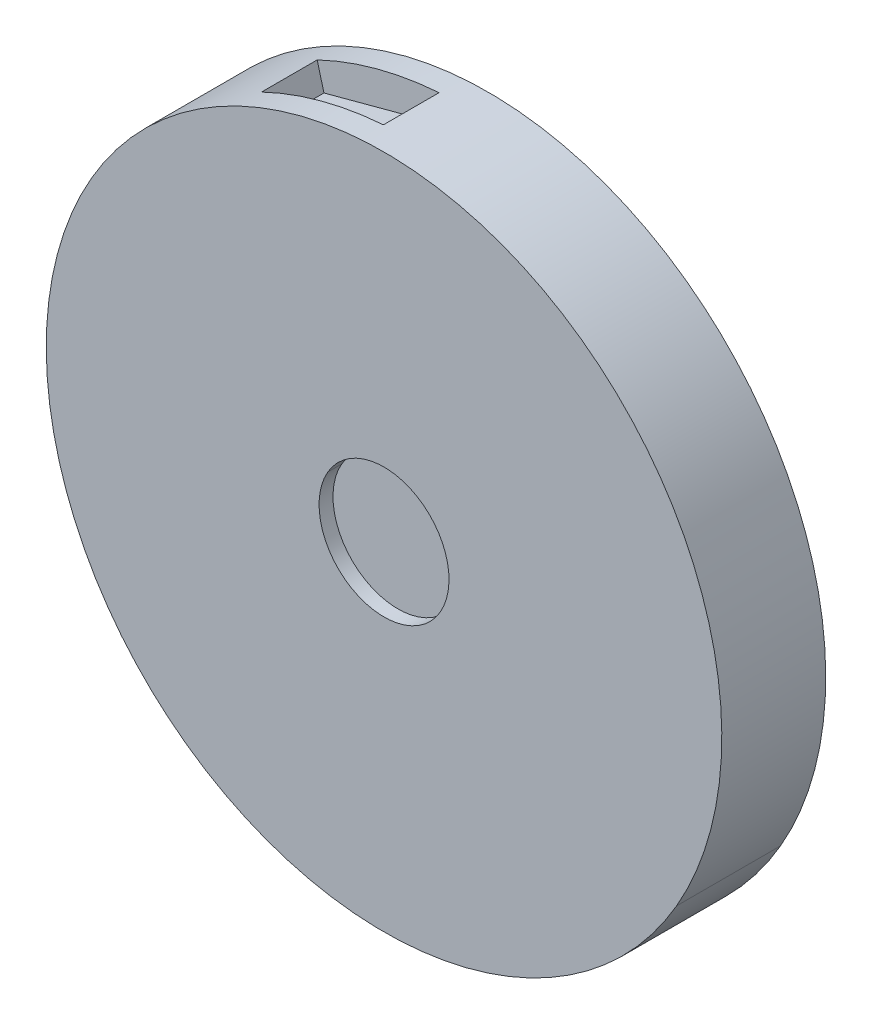
ISO-10303-21;
HEADER;
FILE_DESCRIPTION(('STEP AP214'),'2;1');
FILE_NAME('part.step','',(''),(''),'','','');
FILE_SCHEMA(('AUTOMOTIVE_DESIGN { 1 0 10303 214 1 1 1 1 }'));
ENDSEC;
DATA;
#1=APPLICATION_CONTEXT('core data for automotive mechanical design processes');
#2=APPLICATION_PROTOCOL_DEFINITION('international standard','automotive_design',2000,#1);
#3=PRODUCT_CONTEXT('',#1,'mechanical');
#4=PRODUCT('Part','Part','',(#3));
#5=PRODUCT_RELATED_PRODUCT_CATEGORY('part','',(#4));
#6=PRODUCT_DEFINITION_FORMATION('','',#4);
#7=PRODUCT_DEFINITION_CONTEXT('part definition',#1,'design');
#8=PRODUCT_DEFINITION('design','',#6,#7);
#9=PRODUCT_DEFINITION_SHAPE('','',#8);
#10=(LENGTH_UNIT() NAMED_UNIT(*) SI_UNIT(.MILLI.,.METRE.));
#11=(NAMED_UNIT(*) PLANE_ANGLE_UNIT() SI_UNIT($,.RADIAN.));
#12=(NAMED_UNIT(*) SI_UNIT($,.STERADIAN.) SOLID_ANGLE_UNIT());
#13=UNCERTAINTY_MEASURE_WITH_UNIT(LENGTH_MEASURE(1.E-05),#10,'distance_accuracy_value','');
#14=(GEOMETRIC_REPRESENTATION_CONTEXT(3) GLOBAL_UNCERTAINTY_ASSIGNED_CONTEXT((#13)) GLOBAL_UNIT_ASSIGNED_CONTEXT((#10,
#11,#12)) REPRESENTATION_CONTEXT('',''));
#15=CARTESIAN_POINT('',(0.,0.,0.));
#16=DIRECTION('',(0.,0.,1.));
#17=DIRECTION('',(1.,0.,0.));
#18=AXIS2_PLACEMENT_3D('',#15,#16,#17);
#19=CARTESIAN_POINT('',(-44.4550527685377,16.9656895159303,0.650000000000022));
#20=DIRECTION('',(-0.965925826289068,-0.258819045102523,0.));
#21=DIRECTION('',(-0.258819045102523,0.965925826289068,0.));
#22=AXIS2_PLACEMENT_3D('',#19,#20,#21);
#23=PLANE('',#22);
#24=DIRECTION('',(0.,0.,-1.));
#25=VECTOR('',#24,1.);
#26=CARTESIAN_POINT('',(-44.3021385050177,16.3950057152716,5.));
#27=LINE('',#26,#25);
#28=CARTESIAN_POINT('',(-44.3021385050177,16.3950057152716,1.45000000000002));
#29=VERTEX_POINT('',#28);
#30=CARTESIAN_POINT('',(-44.3021385050177,16.3950057152716,-1.54999999999997));
#31=VERTEX_POINT('',#30);
#32=EDGE_CURVE('E280',#29,#31,#27,.T.);
#33=ORIENTED_EDGE('',*,*,#32,.F.);
#34=DIRECTION('',(-0.258819045102523,0.965925826289068,0.));
#35=VECTOR('',#34,1.);
#36=CARTESIAN_POINT('',(-44.4550527685377,16.9656895159303,1.45000000000002));
#37=LINE('',#36,#35);
#38=CARTESIAN_POINT('',(-43.9374146783326,15.0338378633522,1.45000000000003));
#39=VERTEX_POINT('',#38);
#40=EDGE_CURVE('E256',#39,#29,#37,.T.);
#41=ORIENTED_EDGE('',*,*,#40,.F.);
#42=DIRECTION('',(0.,0.,1.));
#43=VECTOR('',#42,1.);
#44=CARTESIAN_POINT('',(-43.9374146783326,15.0338378633522,-0.749999999999977));
#45=LINE('',#44,#43);
#46=CARTESIAN_POINT('',(-43.9374146783326,15.0338378633522,-1.55));
#47=VERTEX_POINT('',#46);
#48=EDGE_CURVE('E257',#47,#39,#45,.T.);
#49=ORIENTED_EDGE('',*,*,#48,.F.);
#50=DIRECTION('',(0.258819045102523,-0.965925826289068,0.));
#51=VECTOR('',#50,1.);
#52=CARTESIAN_POINT('',(-44.4550527685377,16.9656895159303,-1.54999999999997));
#53=LINE('',#52,#51);
#54=EDGE_CURVE('E28',#31,#47,#53,.T.);
#55=ORIENTED_EDGE('',*,*,#54,.F.);
#56=EDGE_LOOP('',(#33,#41,#49,#55));
#57=FACE_BOUND('',#56,.T.);
#58=ADVANCED_FACE('F17',(#57),#23,.F.);
#59=CARTESIAN_POINT('',(-37.8867570490181,18.7256590496244,-0.749999999999966));
#60=DIRECTION('',(0.965925826289068,0.258819045102523,0.));
#61=DIRECTION('',(0.,0.,-1.));
#62=AXIS2_PLACEMENT_3D('',#59,#60,#61);
#63=PLANE('',#62);
#64=DIRECTION('',(0.,0.,1.));
#65=VECTOR('',#64,1.);
#66=CARTESIAN_POINT('',(-37.7328131492204,18.1511325940641,5.));
#67=LINE('',#66,#65);
#68=CARTESIAN_POINT('',(-37.7328131492204,18.1511325940641,-1.54999999999997));
#69=VERTEX_POINT('',#68);
#70=CARTESIAN_POINT('',(-37.7328131492204,18.1511325940641,1.45000000000002));
#71=VERTEX_POINT('',#70);
#72=EDGE_CURVE('E321',#69,#71,#67,.T.);
#73=ORIENTED_EDGE('',*,*,#72,.F.);
#74=DIRECTION('',(-0.258819045102523,0.965925826289068,0.));
#75=VECTOR('',#74,1.);
#76=CARTESIAN_POINT('',(-37.8867570490181,18.7256590496244,-1.54999999999997));
#77=LINE('',#76,#75);
#78=CARTESIAN_POINT('',(-37.3691189588131,16.7938073970463,-1.54999999999997));
#79=VERTEX_POINT('',#78);
#80=EDGE_CURVE('E11',#79,#69,#77,.T.);
#81=ORIENTED_EDGE('',*,*,#80,.F.);
#82=DIRECTION('',(0.,0.,-1.));
#83=VECTOR('',#82,1.);
#84=CARTESIAN_POINT('',(-37.3691189588131,16.7938073970463,0.650000000000031));
#85=LINE('',#84,#83);
#86=CARTESIAN_POINT('',(-37.3691189588131,16.7938073970463,1.45000000000003));
#87=VERTEX_POINT('',#86);
#88=EDGE_CURVE('E310',#87,#79,#85,.T.);
#89=ORIENTED_EDGE('',*,*,#88,.F.);
#90=DIRECTION('',(0.258819045102523,-0.965925826289068,0.));
#91=VECTOR('',#90,1.);
#92=CARTESIAN_POINT('',(-37.8867570490181,18.7256590496244,1.45000000000002));
#93=LINE('',#92,#91);
#94=EDGE_CURVE('E253',#71,#87,#93,.T.);
#95=ORIENTED_EDGE('',*,*,#94,.F.);
#96=EDGE_LOOP('',(#73,#81,#89,#95));
#97=FACE_BOUND('',#96,.T.);
#98=ADVANCED_FACE('F463',(#97),#63,.F.);
#99=CARTESIAN_POINT('',(-43.9720898553932,17.0950990384816,-1.54999999999997));
#100=DIRECTION('',(0.,0.,-1.));
#101=DIRECTION('',(-1.,0.,0.));
#102=AXIS2_PLACEMENT_3D('',#99,#100,#101);
#103=PLANE('',#102);
#104=CARTESIAN_POINT('',(-36.400000039913,1.44113214695096E-07,-1.55));
#105=DIRECTION('',(0.,0.,-1.));
#106=DIRECTION('',(-0.866025403784439,0.5,0.));
#107=AXIS2_PLACEMENT_3D('',#104,#105,#106);
#108=CIRCLE('',#107,18.2);
#109=EDGE_CURVE('E262',#31,#69,#108,.T.);
#110=ORIENTED_EDGE('',*,*,#109,.F.);
#111=ORIENTED_EDGE('',*,*,#54,.T.);
#112=DIRECTION('',(-0.965925826289068,-0.258819045102523,0.));
#113=VECTOR('',#112,1.);
#114=CARTESIAN_POINT('',(-43.4544517651881,15.1632473859034,-1.55));
#115=LINE('',#114,#113);
#116=EDGE_CURVE('E314',#79,#47,#115,.T.);
#117=ORIENTED_EDGE('',*,*,#116,.F.);
#118=ORIENTED_EDGE('',*,*,#80,.T.);
#119=EDGE_LOOP('',(#110,#111,#117,#118));
#120=FACE_BOUND('',#119,.T.);
#121=ADVANCED_FACE('F469',(#120),#103,.F.);
#122=CARTESIAN_POINT('',(-38.3697199621627,18.5962495270731,1.45000000000003));
#123=DIRECTION('',(0.,0.,1.));
#124=DIRECTION('',(0.,-1.,0.));
#125=AXIS2_PLACEMENT_3D('',#122,#123,#124);
#126=PLANE('',#125);
#127=CARTESIAN_POINT('',(-36.400000039913,1.44113214695096E-07,1.45000000000002));
#128=DIRECTION('',(0.,0.,1.));
#129=DIRECTION('',(-0.866025403784439,0.5,0.));
#130=AXIS2_PLACEMENT_3D('',#127,#128,#129);
#131=CIRCLE('',#130,18.2);
#132=EDGE_CURVE('E333',#71,#29,#131,.T.);
#133=ORIENTED_EDGE('',*,*,#132,.F.);
#134=ORIENTED_EDGE('',*,*,#94,.T.);
#135=DIRECTION('',(0.965925826289068,0.258819045102523,0.));
#136=VECTOR('',#135,1.);
#137=CARTESIAN_POINT('',(-37.8520818719576,16.664397874495,1.45000000000003));
#138=LINE('',#137,#136);
#139=EDGE_CURVE('E222',#39,#87,#138,.T.);
#140=ORIENTED_EDGE('',*,*,#139,.F.);
#141=ORIENTED_EDGE('',*,*,#40,.T.);
#142=EDGE_LOOP('',(#133,#134,#140,#141));
#143=FACE_BOUND('',#142,.T.);
#144=ADVANCED_FACE('F493',(#143),#126,.F.);
#145=CARTESIAN_POINT('',(-40.6532668185729,15.9138226301992,-0.0499999999999723));
#146=DIRECTION('',(-0.258819045102523,0.965925826289068,0.));
#147=DIRECTION('',(0.,0.,1.));
#148=AXIS2_PLACEMENT_3D('',#145,#146,#147);
#149=PLANE('',#148);
#150=ORIENTED_EDGE('',*,*,#139,.T.);
#151=ORIENTED_EDGE('',*,*,#88,.T.);
#152=ORIENTED_EDGE('',*,*,#116,.T.);
#153=ORIENTED_EDGE('',*,*,#48,.T.);
#154=EDGE_LOOP('',(#150,#151,#152,#153));
#155=FACE_BOUND('',#154,.T.);
#156=ADVANCED_FACE('F491',(#155),#149,.T.);
#157=CARTESIAN_POINT('',(-36.400000039913,1.44113214695096E-07,5.));
#158=DIRECTION('',(0.,0.,-1.));
#159=DIRECTION('',(-0.866025403784439,0.5,0.));
#160=AXIS2_PLACEMENT_3D('',#157,#158,#159);
#161=CYLINDRICAL_SURFACE('',#160,18.2);
#162=DIRECTION('',(0.,0.,-1.));
#163=VECTOR('',#162,1.);
#164=CARTESIAN_POINT('',(-20.6383376910362,-9.09999985588678,5.));
#165=LINE('',#164,#163);
#166=CARTESIAN_POINT('',(-20.6383376910362,-9.09999985588678,2.75));
#167=VERTEX_POINT('',#166);
#168=CARTESIAN_POINT('',(-20.6383376910362,-9.09999985588678,-2.85));
#169=VERTEX_POINT('',#168);
#170=EDGE_CURVE('E252',#167,#169,#165,.T.);
#171=ORIENTED_EDGE('',*,*,#170,.F.);
#172=CARTESIAN_POINT('',(-36.400000039913,1.44113214695096E-07,2.75));
#173=DIRECTION('',(0.,0.,-1.));
#174=DIRECTION('',(-0.866025403784439,0.5,0.));
#175=AXIS2_PLACEMENT_3D('',#172,#173,#174);
#176=CIRCLE('',#175,18.2);
#177=CARTESIAN_POINT('',(-52.1616623887898,9.10000014411321,2.75));
#178=VERTEX_POINT('',#177);
#179=EDGE_CURVE('E298',#167,#178,#176,.T.);
#180=ORIENTED_EDGE('',*,*,#179,.T.);
#181=DIRECTION('',(0.,0.,-1.));
#182=VECTOR('',#181,1.);
#183=CARTESIAN_POINT('',(-52.1616623887898,9.10000014411321,5.));
#184=LINE('',#183,#182);
#185=CARTESIAN_POINT('',(-52.1616623887898,9.10000014411321,-2.85));
#186=VERTEX_POINT('',#185);
#187=EDGE_CURVE('E258',#178,#186,#184,.T.);
#188=ORIENTED_EDGE('',*,*,#187,.T.);
#189=CARTESIAN_POINT('',(-36.400000039913,1.44113214695096E-07,-2.85));
#190=DIRECTION('',(0.,0.,-1.));
#191=DIRECTION('',(-0.866025403784439,0.5,0.));
#192=AXIS2_PLACEMENT_3D('',#189,#190,#191);
#193=CIRCLE('',#192,18.2);
#194=EDGE_CURVE('E293',#169,#186,#193,.T.);
#195=ORIENTED_EDGE('',*,*,#194,.F.);
#196=EDGE_LOOP('',(#171,#180,#188,#195));
#197=FACE_BOUND('',#196,.T.);
#198=ADVANCED_FACE('F490',(#197),#161,.T.);
#199=CARTESIAN_POINT('',(-27.0500340703741,-14.5556907143952,-2.84999988079071));
#200=DIRECTION('',(0.,0.,1.));
#201=DIRECTION('',(0.953277739647421,0.302095268239514,0.));
#202=AXIS2_PLACEMENT_3D('',#199,#200,#201);
#203=CYLINDRICAL_SURFACE('',#202,0.2);
#204=CARTESIAN_POINT('',(-27.0500340703741,-14.5556907143952,-2.85));
#205=DIRECTION('',(0.,0.,-1.));
#206=DIRECTION('',(0.953277739647421,0.302095268239514,0.));
#207=AXIS2_PLACEMENT_3D('',#204,#205,#206);
#208=CIRCLE('',#207,0.2);
#209=CARTESIAN_POINT('',(-26.8593785224446,-14.4952716607473,-2.84999988079071));
#210=VERTEX_POINT('',#209);
#211=CARTESIAN_POINT('',(-26.9419419782407,-14.7239645971525,-2.84999988079071));
#212=VERTEX_POINT('',#211);
#213=EDGE_CURVE('E217',#210,#212,#208,.T.);
#214=ORIENTED_EDGE('',*,*,#213,.F.);
#215=DIRECTION('',(0.,0.,1.));
#216=VECTOR('',#215,1.);
#217=CARTESIAN_POINT('',(-26.8593785224446,-14.4952716607473,-2.84999988079071));
#218=LINE('',#217,#216);
#219=CARTESIAN_POINT('',(-26.8593785224447,-14.4952716607473,1.15000011920929));
#220=VERTEX_POINT('',#219);
#221=EDGE_CURVE('E210',#210,#220,#218,.T.);
#222=ORIENTED_EDGE('',*,*,#221,.T.);
#223=CARTESIAN_POINT('',(-27.0500340703741,-14.5556907143952,1.15000011920929));
#224=DIRECTION('',(0.,0.,-1.));
#225=DIRECTION('',(0.953277739647421,0.302095268239514,0.));
#226=AXIS2_PLACEMENT_3D('',#223,#224,#225);
#227=CIRCLE('',#226,0.2);
#228=CARTESIAN_POINT('',(-26.9419419782407,-14.7239645971525,1.15000011920929));
#229=VERTEX_POINT('',#228);
#230=EDGE_CURVE('E214',#220,#229,#227,.T.);
#231=ORIENTED_EDGE('',*,*,#230,.T.);
#232=DIRECTION('',(0.,0.,1.));
#233=VECTOR('',#232,1.);
#234=CARTESIAN_POINT('',(-26.9419419782407,-14.7239645971525,-2.84999988079071));
#235=LINE('',#234,#233);
#236=EDGE_CURVE('E21',#212,#229,#235,.T.);
#237=ORIENTED_EDGE('',*,*,#236,.F.);
#238=EDGE_LOOP('',(#214,#222,#231,#237));
#239=FACE_BOUND('',#238,.T.);
#240=ADVANCED_FACE('F212',(#239),#203,.T.);
#241=CARTESIAN_POINT('',(-24.9528230431498,-13.8910811242682,-2.84999988079071));
#242=DIRECTION('',(0.,0.,1.));
#243=DIRECTION('',(-0.953277739647412,-0.302095268239542,0.));
#244=AXIS2_PLACEMENT_3D('',#241,#242,#243);
#245=CYLINDRICAL_SURFACE('',#244,2.);
#246=CARTESIAN_POINT('',(-24.9528230431498,-13.8910811242682,-2.85));
#247=DIRECTION('',(0.,0.,1.));
#248=DIRECTION('',(-0.953277739647412,-0.302095268239542,0.));
#249=AXIS2_PLACEMENT_3D('',#246,#247,#248);
#250=CIRCLE('',#249,2.);
#251=CARTESIAN_POINT('',(-23.9953811448156,-12.1351468967659,-2.84999988079071));
#252=VERTEX_POINT('',#251);
#253=EDGE_CURVE('E302',#252,#210,#250,.T.);
#254=ORIENTED_EDGE('',*,*,#253,.F.);
#255=DIRECTION('',(0.,0.,1.));
#256=VECTOR('',#255,1.);
#257=CARTESIAN_POINT('',(-23.9953811448156,-12.1351468967659,-2.84999988079071));
#258=LINE('',#257,#256);
#259=CARTESIAN_POINT('',(-23.9953811448156,-12.1351468967659,1.15000011920929));
#260=VERTEX_POINT('',#259);
#261=EDGE_CURVE('E223',#252,#260,#258,.T.);
#262=ORIENTED_EDGE('',*,*,#261,.T.);
#263=CARTESIAN_POINT('',(-24.9528230431498,-13.8910811242682,1.15000011920929));
#264=DIRECTION('',(0.,0.,1.));
#265=DIRECTION('',(-0.953277739647412,-0.302095268239542,0.));
#266=AXIS2_PLACEMENT_3D('',#263,#264,#265);
#267=CIRCLE('',#266,2.);
#268=EDGE_CURVE('E226',#260,#220,#267,.T.);
#269=ORIENTED_EDGE('',*,*,#268,.T.);
#270=ORIENTED_EDGE('',*,*,#221,.F.);
#271=EDGE_LOOP('',(#254,#262,#269,#270));
#272=FACE_BOUND('',#271,.T.);
#273=ADVANCED_FACE('F227',(#272),#245,.F.);
#274=CARTESIAN_POINT('',(-23.8996369549822,-11.9595534740156,-2.84999988079071));
#275=DIRECTION('',(0.,0.,1.));
#276=DIRECTION('',(0.72256434016937,-0.691303677348532,0.));
#277=AXIS2_PLACEMENT_3D('',#274,#275,#276);
#278=CYLINDRICAL_SURFACE('',#277,0.200000000000009);
#279=CARTESIAN_POINT('',(-23.8996369549822,-11.9595534740156,-2.85));
#280=DIRECTION('',(0.,0.,-1.));
#281=DIRECTION('',(0.72256434016937,-0.691303677348532,0.));
#282=AXIS2_PLACEMENT_3D('',#279,#280,#281);
#283=CIRCLE('',#282,0.200000000000009);
#284=CARTESIAN_POINT('',(-23.7551240869483,-12.0978142094853,-2.84999988079071));
#285=VERTEX_POINT('',#284);
#286=EDGE_CURVE('E289',#285,#252,#283,.T.);
#287=ORIENTED_EDGE('',*,*,#286,.F.);
#288=DIRECTION('',(0.,0.,1.));
#289=VECTOR('',#288,1.);
#290=CARTESIAN_POINT('',(-23.7551240869483,-12.0978142094853,-2.84999988079071));
#291=LINE('',#290,#289);
#292=CARTESIAN_POINT('',(-23.7551240869483,-12.0978142094854,1.15000011920929));
#293=VERTEX_POINT('',#292);
#294=EDGE_CURVE('E290',#285,#293,#291,.T.);
#295=ORIENTED_EDGE('',*,*,#294,.T.);
#296=CARTESIAN_POINT('',(-23.8996369549822,-11.9595534740156,1.15000011920929));
#297=DIRECTION('',(0.,0.,-1.));
#298=DIRECTION('',(0.72256434016937,-0.691303677348532,0.));
#299=AXIS2_PLACEMENT_3D('',#296,#297,#298);
#300=CIRCLE('',#299,0.200000000000009);
#301=EDGE_CURVE('E232',#293,#260,#300,.T.);
#302=ORIENTED_EDGE('',*,*,#301,.T.);
#303=ORIENTED_EDGE('',*,*,#261,.F.);
#304=EDGE_LOOP('',(#287,#295,#302,#303));
#305=FACE_BOUND('',#304,.T.);
#306=ADVANCED_FACE('F450',(#305),#278,.T.);
#307=CARTESIAN_POINT('',(-36.400000039913,1.44113210254204E-07,-2.84999988079071));
#308=DIRECTION('',(0.,0.,1.));
#309=DIRECTION('',(0.642787627309709,0.766044428331382,0.));
#310=AXIS2_PLACEMENT_3D('',#307,#308,#309);
#311=CYLINDRICAL_SURFACE('',#310,17.5);
#312=CARTESIAN_POINT('',(-36.400000039913,1.44113210254204E-07,-2.85));
#313=DIRECTION('',(0.,0.,1.));
#314=DIRECTION('',(0.642787627309709,0.766044428331382,0.));
#315=AXIS2_PLACEMENT_3D('',#312,#313,#314);
#316=CIRCLE('',#315,17.5);
#317=EDGE_CURVE('E285',#212,#285,#316,.T.);
#318=ORIENTED_EDGE('',*,*,#317,.F.);
#319=ORIENTED_EDGE('',*,*,#236,.T.);
#320=CARTESIAN_POINT('',(-36.400000039913,1.44113214695096E-07,1.15000011920929));
#321=DIRECTION('',(0.,0.,1.));
#322=DIRECTION('',(0.642787627309709,0.766044428331382,0.));
#323=AXIS2_PLACEMENT_3D('',#320,#321,#322);
#324=CIRCLE('',#323,17.5);
#325=EDGE_CURVE('E236',#229,#293,#324,.T.);
#326=ORIENTED_EDGE('',*,*,#325,.T.);
#327=ORIENTED_EDGE('',*,*,#294,.F.);
#328=EDGE_LOOP('',(#318,#319,#326,#327));
#329=FACE_BOUND('',#328,.T.);
#330=ADVANCED_FACE('F448',(#329),#311,.F.);
#331=CARTESIAN_POINT('',(-36.4000003317925,-2.03614214377978E-07,1.15000011920929));
#332=DIRECTION('',(0.,0.,-1.));
#333=DIRECTION('',(-1.,0.,0.));
#334=AXIS2_PLACEMENT_3D('',#331,#332,#333);
#335=PLANE('',#334);
#336=ORIENTED_EDGE('',*,*,#325,.F.);
#337=ORIENTED_EDGE('',*,*,#230,.F.);
#338=ORIENTED_EDGE('',*,*,#268,.F.);
#339=ORIENTED_EDGE('',*,*,#301,.F.);
#340=EDGE_LOOP('',(#336,#337,#338,#339));
#341=FACE_BOUND('',#340,.T.);
#342=ADVANCED_FACE('F234',(#341),#335,.T.);
#343=CARTESIAN_POINT('',(-49.2162630622612,-11.620387204938,-2.84999988079071));
#344=DIRECTION('',(0.,0.,1.));
#345=DIRECTION('',(-0.740824452158907,-0.671698690696547,0.));
#346=AXIS2_PLACEMENT_3D('',#343,#344,#345);
#347=CYLINDRICAL_SURFACE('',#346,0.200000000000031);
#348=CARTESIAN_POINT('',(-49.2162630622612,-11.620387204938,-2.85));
#349=DIRECTION('',(0.,0.,-1.));
#350=DIRECTION('',(-0.740824452158907,-0.671698690696547,0.));
#351=AXIS2_PLACEMENT_3D('',#348,#349,#350);
#352=CIRCLE('',#351,0.200000000000031);
#353=CARTESIAN_POINT('',(-49.364427952693,-11.7547269430773,-2.84999988079071));
#354=VERTEX_POINT('',#353);
#355=CARTESIAN_POINT('',(-49.4043798111009,-11.5524748437213,-2.84999988079071));
#356=VERTEX_POINT('',#355);
#357=EDGE_CURVE('E268',#354,#356,#352,.T.);
#358=ORIENTED_EDGE('',*,*,#357,.F.);
#359=DIRECTION('',(0.,0.,1.));
#360=VECTOR('',#359,1.);
#361=CARTESIAN_POINT('',(-49.364427952693,-11.7547269430773,-2.84999988079071));
#362=LINE('',#361,#360);
#363=CARTESIAN_POINT('',(-49.364427952693,-11.7547269430773,1.15000011920929));
#364=VERTEX_POINT('',#363);
#365=EDGE_CURVE('E99',#354,#364,#362,.T.);
#366=ORIENTED_EDGE('',*,*,#365,.T.);
#367=CARTESIAN_POINT('',(-49.2162630622612,-11.620387204938,1.15000011920929));
#368=DIRECTION('',(0.,0.,-1.));
#369=DIRECTION('',(-0.740824452158907,-0.671698690696547,0.));
#370=AXIS2_PLACEMENT_3D('',#367,#368,#369);
#371=CIRCLE('',#370,0.200000000000031);
#372=CARTESIAN_POINT('',(-49.4043798111009,-11.5524748437213,1.15000011920929));
#373=VERTEX_POINT('',#372);
#374=EDGE_CURVE('E303',#364,#373,#371,.T.);
#375=ORIENTED_EDGE('',*,*,#374,.T.);
#376=DIRECTION('',(0.,0.,1.));
#377=VECTOR('',#376,1.);
#378=CARTESIAN_POINT('',(-49.4043798111009,-11.5524748437213,-2.84999988079071));
#379=LINE('',#378,#377);
#380=EDGE_CURVE('E359',#356,#373,#379,.T.);
#381=ORIENTED_EDGE('',*,*,#380,.F.);
#382=EDGE_LOOP('',(#358,#366,#375,#381));
#383=FACE_BOUND('',#382,.T.);
#384=ADVANCED_FACE('F507',(#383),#347,.T.);
#385=CARTESIAN_POINT('',(-36.400000039913,1.44113210254204E-07,-2.84999988079071));
#386=DIRECTION('',(0.,0.,1.));
#387=DIRECTION('',(0.642787627309709,0.766044428331382,0.));
#388=AXIS2_PLACEMENT_3D('',#385,#386,#387);
#389=CYLINDRICAL_SURFACE('',#388,17.5);
#390=CARTESIAN_POINT('',(-36.400000039913,1.44113210254204E-07,-2.85));
#391=DIRECTION('',(0.,0.,1.));
#392=DIRECTION('',(0.642787627309709,0.766044428331382,0.));
#393=AXIS2_PLACEMENT_3D('',#390,#391,#392);
#394=CIRCLE('',#393,17.5);
#395=CARTESIAN_POINT('',(-50.4158559843671,-10.4788252740485,-2.84999988079071));
#396=VERTEX_POINT('',#395);
#397=EDGE_CURVE('E284',#396,#354,#394,.T.);
#398=ORIENTED_EDGE('',*,*,#397,.F.);
#399=DIRECTION('',(0.,0.,1.));
#400=VECTOR('',#399,1.);
#401=CARTESIAN_POINT('',(-50.4158559843671,-10.4788252740485,-2.84999988079071));
#402=LINE('',#401,#400);
#403=CARTESIAN_POINT('',(-50.4158559843671,-10.4788252740485,1.15000011920929));
#404=VERTEX_POINT('',#403);
#405=EDGE_CURVE('E82',#396,#404,#402,.T.);
#406=ORIENTED_EDGE('',*,*,#405,.T.);
#407=CARTESIAN_POINT('',(-36.400000039913,1.44113219135988E-07,1.15000011920929));
#408=DIRECTION('',(0.,0.,1.));
#409=DIRECTION('',(0.642787627309709,0.766044428331382,0.));
#410=AXIS2_PLACEMENT_3D('',#407,#408,#409);
#411=CIRCLE('',#410,17.5);
#412=EDGE_CURVE('E306',#404,#364,#411,.T.);
#413=ORIENTED_EDGE('',*,*,#412,.T.);
#414=ORIENTED_EDGE('',*,*,#365,.F.);
#415=EDGE_LOOP('',(#398,#406,#413,#414));
#416=FACE_BOUND('',#415,.T.);
#417=ADVANCED_FACE('F19',(#416),#389,.F.);
#418=CARTESIAN_POINT('',(-50.2556747735733,-10.3590672692695,-2.84999988079071));
#419=DIRECTION('',(0.,0.,1.));
#420=DIRECTION('',(0.153533846656686,-0.988143389357436,0.));
#421=AXIS2_PLACEMENT_3D('',#418,#419,#420);
#422=CYLINDRICAL_SURFACE('',#421,0.200000000000019);
#423=CARTESIAN_POINT('',(-50.2556747735733,-10.3590672692695,-2.85));
#424=DIRECTION('',(0.,0.,-1.));
#425=DIRECTION('',(0.153533846656686,-0.988143389357436,0.));
#426=AXIS2_PLACEMENT_3D('',#423,#424,#425);
#427=CIRCLE('',#426,0.200000000000019);
#428=CARTESIAN_POINT('',(-50.224968004242,-10.556695947141,-2.84999988079071));
#429=VERTEX_POINT('',#428);
#430=EDGE_CURVE('E274',#429,#396,#427,.T.);
#431=ORIENTED_EDGE('',*,*,#430,.F.);
#432=DIRECTION('',(0.,0.,1.));
#433=VECTOR('',#432,1.);
#434=CARTESIAN_POINT('',(-50.224968004242,-10.556695947141,-2.84999988079071));
#435=LINE('',#434,#433);
#436=CARTESIAN_POINT('',(-50.224968004242,-10.556695947141,1.15000011920929));
#437=VERTEX_POINT('',#436);
#438=EDGE_CURVE('E342',#429,#437,#435,.T.);
#439=ORIENTED_EDGE('',*,*,#438,.T.);
#440=CARTESIAN_POINT('',(-50.2556747735733,-10.3590672692695,1.15000011920929));
#441=DIRECTION('',(0.,0.,-1.));
#442=DIRECTION('',(0.153533846656686,-0.988143389357436,0.));
#443=AXIS2_PLACEMENT_3D('',#440,#441,#442);
#444=CIRCLE('',#443,0.200000000000019);
#445=EDGE_CURVE('E386',#437,#404,#444,.T.);
#446=ORIENTED_EDGE('',*,*,#445,.T.);
#447=ORIENTED_EDGE('',*,*,#405,.F.);
#448=EDGE_LOOP('',(#431,#439,#446,#447));
#449=FACE_BOUND('',#448,.T.);
#450=ADVANCED_FACE('F513',(#449),#422,.T.);
#451=CARTESIAN_POINT('',(-50.1098176192494,-11.297803489159,-2.84999988079071));
#452=DIRECTION('',(0.,0.,1.));
#453=DIRECTION('',(-0.153533846656774,0.988143389357422,0.));
#454=AXIS2_PLACEMENT_3D('',#451,#452,#453);
#455=CYLINDRICAL_SURFACE('',#454,0.75);
#456=CARTESIAN_POINT('',(-50.1098176192494,-11.297803489159,-2.85));
#457=DIRECTION('',(0.,0.,1.));
#458=DIRECTION('',(-0.153533846656774,0.988143389357422,0.));
#459=AXIS2_PLACEMENT_3D('',#456,#457,#458);
#460=CIRCLE('',#459,0.75);
#461=EDGE_CURVE('E270',#356,#429,#460,.T.);
#462=ORIENTED_EDGE('',*,*,#461,.F.);
#463=ORIENTED_EDGE('',*,*,#380,.T.);
#464=CARTESIAN_POINT('',(-50.1098176192494,-11.297803489159,1.15000011920929));
#465=DIRECTION('',(0.,0.,1.));
#466=DIRECTION('',(-0.153533846656774,0.988143389357422,0.));
#467=AXIS2_PLACEMENT_3D('',#464,#465,#466);
#468=CIRCLE('',#467,0.75);
#469=EDGE_CURVE('E307',#373,#437,#468,.T.);
#470=ORIENTED_EDGE('',*,*,#469,.T.);
#471=ORIENTED_EDGE('',*,*,#438,.F.);
#472=EDGE_LOOP('',(#462,#463,#470,#471));
#473=FACE_BOUND('',#472,.T.);
#474=ADVANCED_FACE('F510',(#473),#455,.F.);
#475=CARTESIAN_POINT('',(-36.4000003317925,-2.03614209937086E-07,1.15000011920929));
#476=DIRECTION('',(0.,0.,-1.));
#477=DIRECTION('',(-1.,0.,0.));
#478=AXIS2_PLACEMENT_3D('',#475,#476,#477);
#479=PLANE('',#478);
#480=ORIENTED_EDGE('',*,*,#469,.F.);
#481=ORIENTED_EDGE('',*,*,#374,.F.);
#482=ORIENTED_EDGE('',*,*,#412,.F.);
#483=ORIENTED_EDGE('',*,*,#445,.F.);
#484=EDGE_LOOP('',(#480,#481,#482,#483));
#485=FACE_BOUND('',#484,.T.);
#486=ADVANCED_FACE('F475',(#485),#479,.T.);
#487=CARTESIAN_POINT('',(-45.7499660094519,14.5556910026216,-2.84999988079071));
#488=DIRECTION('',(0.,0.,1.));
#489=DIRECTION('',(-0.953277739647408,-0.302095268239553,0.));
#490=AXIS2_PLACEMENT_3D('',#487,#488,#489);
#491=CYLINDRICAL_SURFACE('',#490,0.200000000000003);
#492=CARTESIAN_POINT('',(-45.7499660094519,14.5556910026216,-2.85));
#493=DIRECTION('',(0.,0.,-1.));
#494=DIRECTION('',(-0.953277739647408,-0.302095268239553,0.));
#495=AXIS2_PLACEMENT_3D('',#492,#493,#494);
#496=CIRCLE('',#495,0.200000000000003);
#497=CARTESIAN_POINT('',(-45.9406215573814,14.4952719489737,-2.84999988079071));
#498=VERTEX_POINT('',#497);
#499=CARTESIAN_POINT('',(-45.8580581015853,14.7239648853789,-2.84999988079071));
#500=VERTEX_POINT('',#499);
#501=EDGE_CURVE('E296',#498,#500,#496,.T.);
#502=ORIENTED_EDGE('',*,*,#501,.F.);
#503=DIRECTION('',(0.,0.,1.));
#504=VECTOR('',#503,1.);
#505=CARTESIAN_POINT('',(-45.9406215573814,14.4952719489737,-2.84999988079071));
#506=LINE('',#505,#504);
#507=CARTESIAN_POINT('',(-45.9406215573814,14.4952719489737,1.15000011920929));
#508=VERTEX_POINT('',#507);
#509=EDGE_CURVE('E383',#498,#508,#506,.T.);
#510=ORIENTED_EDGE('',*,*,#509,.T.);
#511=CARTESIAN_POINT('',(-45.7499660094519,14.5556910026216,1.15000011920929));
#512=DIRECTION('',(0.,0.,-1.));
#513=DIRECTION('',(-0.953277739647408,-0.302095268239553,0.));
#514=AXIS2_PLACEMENT_3D('',#511,#512,#513);
#515=CIRCLE('',#514,0.200000000000003);
#516=CARTESIAN_POINT('',(-45.8580581015853,14.7239648853789,1.15000011920929));
#517=VERTEX_POINT('',#516);
#518=EDGE_CURVE('E360',#508,#517,#515,.T.);
#519=ORIENTED_EDGE('',*,*,#518,.T.);
#520=DIRECTION('',(0.,0.,1.));
#521=VECTOR('',#520,1.);
#522=CARTESIAN_POINT('',(-45.8580581015853,14.7239648853789,-2.84999988079071));
#523=LINE('',#522,#521);
#524=EDGE_CURVE('E365',#500,#517,#523,.T.);
#525=ORIENTED_EDGE('',*,*,#524,.F.);
#526=EDGE_LOOP('',(#502,#510,#519,#525));
#527=FACE_BOUND('',#526,.T.);
#528=ADVANCED_FACE('F535',(#527),#491,.T.);
#529=CARTESIAN_POINT('',(-47.8471770366762,13.8910814124946,-2.84999988079071));
#530=DIRECTION('',(0.,0.,1.));
#531=DIRECTION('',(0.953277739647409,0.302095268239553,0.));
#532=AXIS2_PLACEMENT_3D('',#529,#530,#531);
#533=CYLINDRICAL_SURFACE('',#532,2.);
#534=CARTESIAN_POINT('',(-47.8471770366762,13.8910814124946,-2.85));
#535=DIRECTION('',(0.,0.,1.));
#536=DIRECTION('',(0.953277739647409,0.302095268239553,0.));
#537=AXIS2_PLACEMENT_3D('',#534,#535,#536);
#538=CIRCLE('',#537,2.);
#539=CARTESIAN_POINT('',(-48.8046189350104,12.1351471849923,-2.84999988079071));
#540=VERTEX_POINT('',#539);
#541=EDGE_CURVE('E264',#540,#498,#538,.T.);
#542=ORIENTED_EDGE('',*,*,#541,.F.);
#543=DIRECTION('',(0.,0.,1.));
#544=VECTOR('',#543,1.);
#545=CARTESIAN_POINT('',(-48.8046189350104,12.1351471849923,-2.84999988079071));
#546=LINE('',#545,#544);
#547=CARTESIAN_POINT('',(-48.8046189350104,12.1351471849923,1.15000011920929));
#548=VERTEX_POINT('',#547);
#549=EDGE_CURVE('E389',#540,#548,#546,.T.);
#550=ORIENTED_EDGE('',*,*,#549,.T.);
#551=CARTESIAN_POINT('',(-47.8471770366762,13.8910814124946,1.15000011920929));
#552=DIRECTION('',(0.,0.,1.));
#553=DIRECTION('',(0.953277739647409,0.302095268239553,0.));
#554=AXIS2_PLACEMENT_3D('',#551,#552,#553);
#555=CIRCLE('',#554,2.);
#556=EDGE_CURVE('E364',#548,#508,#555,.T.);
#557=ORIENTED_EDGE('',*,*,#556,.T.);
#558=ORIENTED_EDGE('',*,*,#509,.F.);
#559=EDGE_LOOP('',(#542,#550,#557,#558));
#560=FACE_BOUND('',#559,.T.);
#561=ADVANCED_FACE('F506',(#560),#533,.F.);
#562=CARTESIAN_POINT('',(-48.9003631248438,11.959553762242,-2.84999988079071));
#563=DIRECTION('',(0.,0.,1.));
#564=DIRECTION('',(-0.7225643401694,0.691303677348501,0.));
#565=AXIS2_PLACEMENT_3D('',#562,#563,#564);
#566=CYLINDRICAL_SURFACE('',#565,0.20000000000001);
#567=CARTESIAN_POINT('',(-48.9003631248438,11.959553762242,-2.85));
#568=DIRECTION('',(0.,0.,-1.));
#569=DIRECTION('',(-0.7225643401694,0.691303677348501,0.));
#570=AXIS2_PLACEMENT_3D('',#567,#568,#569);
#571=CIRCLE('',#570,0.20000000000001);
#572=CARTESIAN_POINT('',(-49.0448759928777,12.0978144977117,-2.84999988079071));
#573=VERTEX_POINT('',#572);
#574=EDGE_CURVE('E269',#573,#540,#571,.T.);
#575=ORIENTED_EDGE('',*,*,#574,.F.);
#576=DIRECTION('',(0.,0.,1.));
#577=VECTOR('',#576,1.);
#578=CARTESIAN_POINT('',(-49.0448759928777,12.0978144977117,-2.84999988079071));
#579=LINE('',#578,#577);
#580=CARTESIAN_POINT('',(-49.0448759928777,12.0978144977117,1.15000011920929));
#581=VERTEX_POINT('',#580);
#582=EDGE_CURVE('E368',#573,#581,#579,.T.);
#583=ORIENTED_EDGE('',*,*,#582,.T.);
#584=CARTESIAN_POINT('',(-48.9003631248438,11.959553762242,1.15000011920929));
#585=DIRECTION('',(0.,0.,-1.));
#586=DIRECTION('',(-0.7225643401694,0.691303677348501,0.));
#587=AXIS2_PLACEMENT_3D('',#584,#585,#586);
#588=CIRCLE('',#587,0.20000000000001);
#589=EDGE_CURVE('E247',#581,#548,#588,.T.);
#590=ORIENTED_EDGE('',*,*,#589,.T.);
#591=ORIENTED_EDGE('',*,*,#549,.F.);
#592=EDGE_LOOP('',(#575,#583,#590,#591));
#593=FACE_BOUND('',#592,.T.);
#594=ADVANCED_FACE('F503',(#593),#566,.T.);
#595=CARTESIAN_POINT('',(-36.400000039913,1.44113210254204E-07,-2.84999988079071));
#596=DIRECTION('',(0.,0.,1.));
#597=DIRECTION('',(0.642787627309709,0.766044428331382,0.));
#598=AXIS2_PLACEMENT_3D('',#595,#596,#597);
#599=CYLINDRICAL_SURFACE('',#598,17.5);
#600=CARTESIAN_POINT('',(-36.400000039913,1.44113210254204E-07,-2.85));
#601=DIRECTION('',(0.,0.,1.));
#602=DIRECTION('',(0.642787627309709,0.766044428331382,0.));
#603=AXIS2_PLACEMENT_3D('',#600,#601,#602);
#604=CIRCLE('',#603,17.5);
#605=EDGE_CURVE('E349',#500,#573,#604,.T.);
#606=ORIENTED_EDGE('',*,*,#605,.F.);
#607=ORIENTED_EDGE('',*,*,#524,.T.);
#608=CARTESIAN_POINT('',(-36.400000039913,1.44113214695096E-07,1.15000011920929));
#609=DIRECTION('',(0.,0.,1.));
#610=DIRECTION('',(0.642787627309709,0.766044428331382,0.));
#611=AXIS2_PLACEMENT_3D('',#608,#609,#610);
#612=CIRCLE('',#611,17.5);
#613=EDGE_CURVE('E301',#517,#581,#612,.T.);
#614=ORIENTED_EDGE('',*,*,#613,.T.);
#615=ORIENTED_EDGE('',*,*,#582,.F.);
#616=EDGE_LOOP('',(#606,#607,#614,#615));
#617=FACE_BOUND('',#616,.T.);
#618=ADVANCED_FACE('F501',(#617),#599,.F.);
#619=CARTESIAN_POINT('',(-36.4000003317925,-2.03614214377978E-07,1.15000011920929));
#620=DIRECTION('',(0.,0.,-1.));
#621=DIRECTION('',(-1.,0.,0.));
#622=AXIS2_PLACEMENT_3D('',#619,#620,#621);
#623=PLANE('',#622);
#624=ORIENTED_EDGE('',*,*,#613,.F.);
#625=ORIENTED_EDGE('',*,*,#518,.F.);
#626=ORIENTED_EDGE('',*,*,#556,.F.);
#627=ORIENTED_EDGE('',*,*,#589,.F.);
#628=EDGE_LOOP('',(#624,#625,#626,#627));
#629=FACE_BOUND('',#628,.T.);
#630=ADVANCED_FACE('F480',(#629),#623,.T.);
#631=CARTESIAN_POINT('',(-36.400000039913,1.44113214695096E-07,2.75));
#632=DIRECTION('',(0.,0.,-1.));
#633=DIRECTION('',(-1.,0.,0.));
#634=AXIS2_PLACEMENT_3D('',#631,#632,#633);
#635=PLANE('',#634);
#636=CARTESIAN_POINT('',(-36.400000039913,1.44113214695096E-07,2.75));
#637=DIRECTION('',(0.,0.,-1.));
#638=DIRECTION('',(-0.866025403784439,0.5,0.));
#639=AXIS2_PLACEMENT_3D('',#636,#637,#638);
#640=CIRCLE('',#639,3.5);
#641=CARTESIAN_POINT('',(-39.4310889531586,1.75000014411321,2.75));
#642=VERTEX_POINT('',#641);
#643=CARTESIAN_POINT('',(-33.3689111266675,-1.74999985588678,2.75));
#644=VERTEX_POINT('',#643);
#645=EDGE_CURVE('E336',#642,#644,#640,.T.);
#646=ORIENTED_EDGE('',*,*,#645,.T.);
#647=CARTESIAN_POINT('',(-36.400000039913,1.44113214695096E-07,2.75));
#648=DIRECTION('',(0.,0.,-1.));
#649=DIRECTION('',(-0.866025403784439,0.5,0.));
#650=AXIS2_PLACEMENT_3D('',#647,#648,#649);
#651=CIRCLE('',#650,3.5);
#652=EDGE_CURVE('E275',#644,#642,#651,.T.);
#653=ORIENTED_EDGE('',*,*,#652,.T.);
#654=EDGE_LOOP('',(#646,#653));
#655=FACE_BOUND('',#654,.T.);
#656=CARTESIAN_POINT('',(-36.400000039913,1.44113214695096E-07,2.75));
#657=DIRECTION('',(0.,0.,-1.));
#658=DIRECTION('',(-0.866025403784439,0.5,0.));
#659=AXIS2_PLACEMENT_3D('',#656,#657,#658);
#660=CIRCLE('',#659,18.2);
#661=EDGE_CURVE('E249',#178,#167,#660,.T.);
#662=ORIENTED_EDGE('',*,*,#661,.F.);
#663=ORIENTED_EDGE('',*,*,#179,.F.);
#664=EDGE_LOOP('',(#662,#663));
#665=FACE_BOUND('',#664,.T.);
#666=ADVANCED_FACE('F477',(#655,#665),#635,.F.);
#667=CARTESIAN_POINT('',(-36.400000039913,1.44113214695096E-07,-2.85));
#668=DIRECTION('',(0.,0.,-1.));
#669=DIRECTION('',(-1.,0.,0.));
#670=AXIS2_PLACEMENT_3D('',#667,#668,#669);
#671=PLANE('',#670);
#672=ORIENTED_EDGE('',*,*,#213,.T.);
#673=ORIENTED_EDGE('',*,*,#317,.T.);
#674=ORIENTED_EDGE('',*,*,#286,.T.);
#675=ORIENTED_EDGE('',*,*,#253,.T.);
#676=EDGE_LOOP('',(#672,#673,#674,#675));
#677=FACE_BOUND('',#676,.T.);
#678=ORIENTED_EDGE('',*,*,#357,.T.);
#679=ORIENTED_EDGE('',*,*,#461,.T.);
#680=ORIENTED_EDGE('',*,*,#430,.T.);
#681=ORIENTED_EDGE('',*,*,#397,.T.);
#682=EDGE_LOOP('',(#678,#679,#680,#681));
#683=FACE_BOUND('',#682,.T.);
#684=ORIENTED_EDGE('',*,*,#501,.T.);
#685=ORIENTED_EDGE('',*,*,#605,.T.);
#686=ORIENTED_EDGE('',*,*,#574,.T.);
#687=ORIENTED_EDGE('',*,*,#541,.T.);
#688=EDGE_LOOP('',(#684,#685,#686,#687));
#689=FACE_BOUND('',#688,.T.);
#690=CARTESIAN_POINT('',(-36.400000039913,1.44113214695096E-07,-2.85));
#691=DIRECTION('',(0.,0.,-1.));
#692=DIRECTION('',(-0.866025403784439,0.5,0.));
#693=AXIS2_PLACEMENT_3D('',#690,#691,#692);
#694=CIRCLE('',#693,18.2);
#695=EDGE_CURVE('E263',#186,#169,#694,.T.);
#696=ORIENTED_EDGE('',*,*,#695,.T.);
#697=ORIENTED_EDGE('',*,*,#194,.T.);
#698=EDGE_LOOP('',(#696,#697));
#699=FACE_BOUND('',#698,.T.);
#700=ADVANCED_FACE('F444',(#677,#683,#689,#699),#671,.T.);
#701=CARTESIAN_POINT('',(-36.400000039913,1.44113214695096E-07,2.));
#702=DIRECTION('',(0.,0.,1.));
#703=DIRECTION('',(1.,0.,0.));
#704=AXIS2_PLACEMENT_3D('',#701,#702,#703);
#705=PLANE('',#704);
#706=CARTESIAN_POINT('',(-36.400000039913,1.44113214695096E-07,2.));
#707=DIRECTION('',(0.,0.,-1.));
#708=DIRECTION('',(-0.866025403784439,0.5,0.));
#709=AXIS2_PLACEMENT_3D('',#706,#707,#708);
#710=CIRCLE('',#709,3.5);
#711=CARTESIAN_POINT('',(-39.4310889531586,1.75000014411321,2.));
#712=VERTEX_POINT('',#711);
#713=CARTESIAN_POINT('',(-33.3689111266675,-1.74999985588678,2.));
#714=VERTEX_POINT('',#713);
#715=EDGE_CURVE('E297',#712,#714,#710,.T.);
#716=ORIENTED_EDGE('',*,*,#715,.F.);
#717=CARTESIAN_POINT('',(-36.400000039913,1.44113214695096E-07,2.));
#718=DIRECTION('',(0.,0.,-1.));
#719=DIRECTION('',(-0.866025403784439,0.5,0.));
#720=AXIS2_PLACEMENT_3D('',#717,#718,#719);
#721=CIRCLE('',#720,3.5);
#722=EDGE_CURVE('E353',#714,#712,#721,.T.);
#723=ORIENTED_EDGE('',*,*,#722,.F.);
#724=EDGE_LOOP('',(#716,#723));
#725=FACE_BOUND('',#724,.T.);
#726=ADVANCED_FACE('F520',(#725),#705,.T.);
#727=CARTESIAN_POINT('',(-36.400000039913,1.44113214695096E-07,2.75));
#728=DIRECTION('',(0.,0.,-1.));
#729=DIRECTION('',(-0.866025403784439,0.5,0.));
#730=AXIS2_PLACEMENT_3D('',#727,#728,#729);
#731=CYLINDRICAL_SURFACE('',#730,3.5);
#732=DIRECTION('',(0.,0.,-1.));
#733=VECTOR('',#732,1.);
#734=CARTESIAN_POINT('',(-33.3689111266675,-1.74999985588678,2.75));
#735=LINE('',#734,#733);
#736=EDGE_CURVE('E279',#644,#714,#735,.T.);
#737=ORIENTED_EDGE('',*,*,#736,.F.);
#738=ORIENTED_EDGE('',*,*,#645,.F.);
#739=DIRECTION('',(0.,0.,-1.));
#740=VECTOR('',#739,1.);
#741=CARTESIAN_POINT('',(-39.4310889531586,1.75000014411321,2.75));
#742=LINE('',#741,#740);
#743=EDGE_CURVE('E339',#642,#712,#742,.T.);
#744=ORIENTED_EDGE('',*,*,#743,.T.);
#745=ORIENTED_EDGE('',*,*,#715,.T.);
#746=EDGE_LOOP('',(#737,#738,#744,#745));
#747=FACE_BOUND('',#746,.T.);
#748=ADVANCED_FACE('F486',(#747),#731,.F.);
#749=CARTESIAN_POINT('',(-36.400000039913,1.44113214695096E-07,2.75));
#750=DIRECTION('',(0.,0.,-1.));
#751=DIRECTION('',(-0.866025403784439,0.5,0.));
#752=AXIS2_PLACEMENT_3D('',#749,#750,#751);
#753=CYLINDRICAL_SURFACE('',#752,3.5);
#754=ORIENTED_EDGE('',*,*,#652,.F.);
#755=ORIENTED_EDGE('',*,*,#736,.T.);
#756=ORIENTED_EDGE('',*,*,#722,.T.);
#757=ORIENTED_EDGE('',*,*,#743,.F.);
#758=EDGE_LOOP('',(#754,#755,#756,#757));
#759=FACE_BOUND('',#758,.T.);
#760=ADVANCED_FACE('F482',(#759),#753,.F.);
#761=CARTESIAN_POINT('',(-36.400000039913,1.44113214695096E-07,5.));
#762=DIRECTION('',(0.,0.,-1.));
#763=DIRECTION('',(-0.866025403784439,0.5,0.));
#764=AXIS2_PLACEMENT_3D('',#761,#762,#763);
#765=CYLINDRICAL_SURFACE('',#764,18.2);
#766=ORIENTED_EDGE('',*,*,#109,.T.);
#767=ORIENTED_EDGE('',*,*,#72,.T.);
#768=ORIENTED_EDGE('',*,*,#132,.T.);
#769=ORIENTED_EDGE('',*,*,#32,.T.);
#770=EDGE_LOOP('',(#766,#767,#768,#769));
#771=FACE_BOUND('',#770,.T.);
#772=ORIENTED_EDGE('',*,*,#661,.T.);
#773=ORIENTED_EDGE('',*,*,#170,.T.);
#774=ORIENTED_EDGE('',*,*,#695,.F.);
#775=ORIENTED_EDGE('',*,*,#187,.F.);
#776=EDGE_LOOP('',(#772,#773,#774,#775));
#777=FACE_BOUND('',#776,.T.);
#778=ADVANCED_FACE('F485',(#771,#777),#765,.T.);
#779=CLOSED_SHELL('',(#58,#98,#121,#144,#156,#198,#240,#273,#306,#330,#342,#384,#417,#450,#474,
#486,#528,#561,#594,#618,#630,#666,#700,#726,#748,#760,#778));
#780=MANIFOLD_SOLID_BREP('B1',#779);
#781=ADVANCED_BREP_SHAPE_REPRESENTATION('',(#18,#780),#14);
#782=SHAPE_DEFINITION_REPRESENTATION(#9,#781);
ENDSEC;
END-ISO-10303-21;
